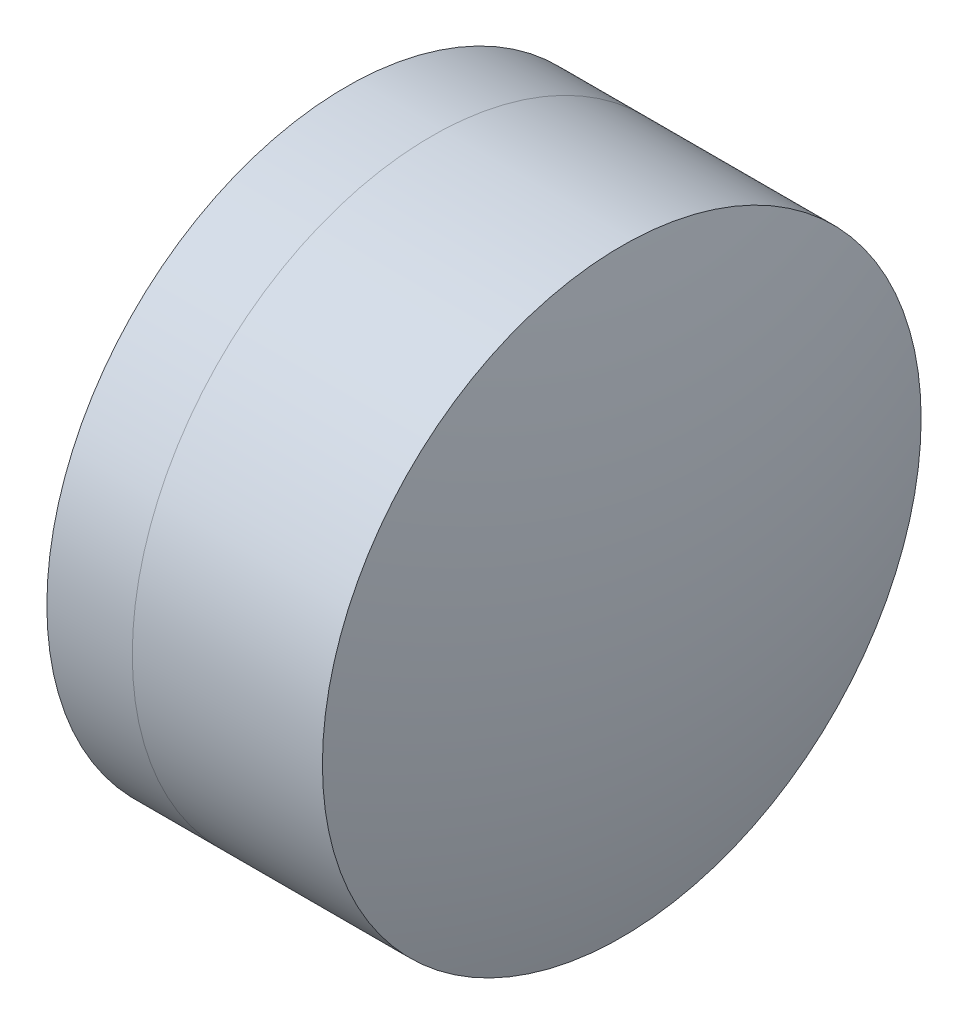
ISO-10303-21;
HEADER;
FILE_DESCRIPTION(('STEP AP214'),'2;1');
FILE_NAME('part.step','',(''),(''),'','','');
FILE_SCHEMA(('AUTOMOTIVE_DESIGN { 1 0 10303 214 1 1 1 1 }'));
ENDSEC;
DATA;
#1=APPLICATION_CONTEXT('core data for automotive mechanical design processes');
#2=APPLICATION_PROTOCOL_DEFINITION('international standard','automotive_design',2000,#1);
#3=PRODUCT_CONTEXT('',#1,'mechanical');
#4=PRODUCT('Part','Part','',(#3));
#5=PRODUCT_RELATED_PRODUCT_CATEGORY('part','',(#4));
#6=PRODUCT_DEFINITION_FORMATION('','',#4);
#7=PRODUCT_DEFINITION_CONTEXT('part definition',#1,'design');
#8=PRODUCT_DEFINITION('design','',#6,#7);
#9=PRODUCT_DEFINITION_SHAPE('','',#8);
#10=(LENGTH_UNIT() NAMED_UNIT(*) SI_UNIT(.MILLI.,.METRE.));
#11=(NAMED_UNIT(*) PLANE_ANGLE_UNIT() SI_UNIT($,.RADIAN.));
#12=(NAMED_UNIT(*) SI_UNIT($,.STERADIAN.) SOLID_ANGLE_UNIT());
#13=UNCERTAINTY_MEASURE_WITH_UNIT(LENGTH_MEASURE(1.E-05),#10,'distance_accuracy_value','');
#14=(GEOMETRIC_REPRESENTATION_CONTEXT(3) GLOBAL_UNCERTAINTY_ASSIGNED_CONTEXT((#13)) GLOBAL_UNIT_ASSIGNED_CONTEXT((#10,
#11,#12)) REPRESENTATION_CONTEXT('',''));
#15=CARTESIAN_POINT('',(0.,0.,0.));
#16=DIRECTION('',(0.,0.,1.));
#17=DIRECTION('',(1.,0.,0.));
#18=AXIS2_PLACEMENT_3D('',#15,#16,#17);
#19=CARTESIAN_POINT('',(-1.34204051591689,0.,0.));
#20=DIRECTION('',(-1.,0.,0.));
#21=DIRECTION('',(0.,0.,-1.));
#22=AXIS2_PLACEMENT_3D('',#19,#20,#21);
#23=SPHERICAL_SURFACE('',#22,4.89);
#24=CARTESIAN_POINT('',(2.3770285880391,0.,0.));
#25=DIRECTION('',(-1.,0.,0.));
#26=DIRECTION('',(0.,0.,1.));
#27=AXIS2_PLACEMENT_3D('',#24,#25,#26);
#28=CIRCLE('',#27,3.175);
#29=CARTESIAN_POINT('',(2.3770285880391,0.,3.175));
#30=VERTEX_POINT('',#29);
#31=EDGE_CURVE('E51',#30,#30,#28,.T.);
#32=ORIENTED_EDGE('',*,*,#31,.T.);
#33=EDGE_LOOP('',(#32));
#34=FACE_BOUND('',#33,.T.);
#35=ADVANCED_FACE('F45',(#34),#23,.F.);
#36=CARTESIAN_POINT('',(-6.47204051591689,0.,0.));
#37=DIRECTION('',(-1.,0.,0.));
#38=DIRECTION('',(0.,0.,-1.));
#39=AXIS2_PLACEMENT_3D('',#36,#37,#38);
#40=SPHERICAL_SURFACE('',#39,11.32);
#41=CARTESIAN_POINT('',(4.39358302808646,0.,0.));
#42=DIRECTION('',(-1.,0.,0.));
#43=DIRECTION('',(0.,0.,1.));
#44=AXIS2_PLACEMENT_3D('',#41,#42,#43);
#45=CIRCLE('',#44,3.175);
#46=CARTESIAN_POINT('',(4.39358302808646,0.,3.175));
#47=VERTEX_POINT('',#46);
#48=EDGE_CURVE('E11',#47,#47,#45,.T.);
#49=ORIENTED_EDGE('',*,*,#48,.F.);
#50=EDGE_LOOP('',(#49));
#51=FACE_BOUND('',#50,.T.);
#52=ADVANCED_FACE('F60',(#51),#40,.T.);
#53=CARTESIAN_POINT('',(-0.551919992657797,0.,0.));
#54=DIRECTION('',(-1.,0.,0.));
#55=DIRECTION('',(0.,0.,1.));
#56=AXIS2_PLACEMENT_3D('',#53,#54,#55);
#57=CYLINDRICAL_SURFACE('',#56,3.175);
#58=ORIENTED_EDGE('',*,*,#48,.T.);
#59=EDGE_LOOP('',(#58));
#60=FACE_BOUND('',#59,.T.);
#61=ORIENTED_EDGE('',*,*,#31,.F.);
#62=EDGE_LOOP('',(#61));
#63=FACE_BOUND('',#62,.T.);
#64=ADVANCED_FACE('F58',(#60,#63),#57,.T.);
#65=CLOSED_SHELL('',(#35,#52,#64));
#66=MANIFOLD_SOLID_BREP('B2',#65);
#67=CARTESIAN_POINT('',(23.9479594840831,0.,0.));
#68=DIRECTION('',(-1.,0.,0.));
#69=DIRECTION('',(0.,0.,1.));
#70=AXIS2_PLACEMENT_3D('',#67,#68,#69);
#71=SPHERICAL_SURFACE('',#70,22.7);
#72=CARTESIAN_POINT('',(1.47109637999314,0.,0.));
#73=DIRECTION('',(-1.,0.,0.));
#74=DIRECTION('',(0.,0.,1.));
#75=AXIS2_PLACEMENT_3D('',#72,#73,#74);
#76=CIRCLE('',#75,3.175);
#77=CARTESIAN_POINT('',(1.47109637999314,0.,3.175));
#78=VERTEX_POINT('',#77);
#79=EDGE_CURVE('E44',#78,#78,#76,.T.);
#80=ORIENTED_EDGE('',*,*,#79,.T.);
#81=EDGE_LOOP('',(#80));
#82=FACE_BOUND('',#81,.T.);
#83=ADVANCED_FACE('F86',(#82),#71,.T.);
#84=CARTESIAN_POINT('',(-0.816062176165804,0.,0.));
#85=DIRECTION('',(-1.,0.,0.));
#86=DIRECTION('',(0.,0.,1.));
#87=AXIS2_PLACEMENT_3D('',#84,#85,#86);
#88=CYLINDRICAL_SURFACE('',#87,3.175);
#89=CARTESIAN_POINT('',(2.3770285880391,0.,0.));
#90=DIRECTION('',(-1.,0.,0.));
#91=DIRECTION('',(0.,0.,1.));
#92=AXIS2_PLACEMENT_3D('',#89,#90,#91);
#93=CIRCLE('',#92,3.175);
#94=CARTESIAN_POINT('',(2.3770285880391,0.,3.175));
#95=VERTEX_POINT('',#94);
#96=EDGE_CURVE('E92',#95,#95,#93,.T.);
#97=ORIENTED_EDGE('',*,*,#96,.T.);
#98=EDGE_LOOP('',(#97));
#99=FACE_BOUND('',#98,.T.);
#100=ORIENTED_EDGE('',*,*,#79,.F.);
#101=EDGE_LOOP('',(#100));
#102=FACE_BOUND('',#101,.T.);
#103=ADVANCED_FACE('F98',(#99,#102),#88,.T.);
#104=CARTESIAN_POINT('',(-1.34204051591689,0.,0.));
#105=DIRECTION('',(-1.,0.,0.));
#106=DIRECTION('',(0.,0.,1.));
#107=AXIS2_PLACEMENT_3D('',#104,#105,#106);
#108=SPHERICAL_SURFACE('',#107,4.89);
#109=ORIENTED_EDGE('',*,*,#96,.F.);
#110=EDGE_LOOP('',(#109));
#111=FACE_BOUND('',#110,.T.);
#112=ADVANCED_FACE('F101',(#111),#108,.T.);
#113=CLOSED_SHELL('',(#83,#103,#112));
#114=MANIFOLD_SOLID_BREP('B6',#113);
#115=ADVANCED_BREP_SHAPE_REPRESENTATION('',(#18,#66,#114),#14);
#116=SHAPE_DEFINITION_REPRESENTATION(#9,#115);
ENDSEC;
END-ISO-10303-21;
